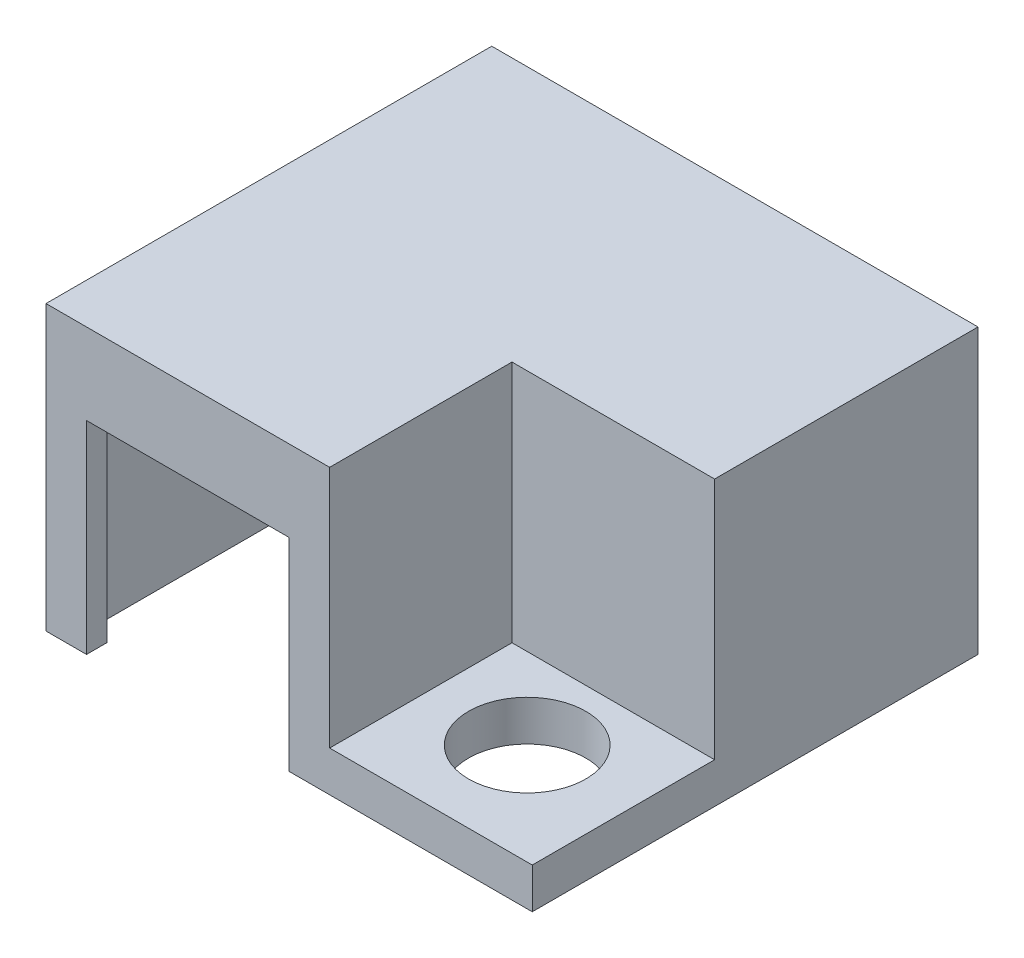
ISO-10303-21;
HEADER;
FILE_DESCRIPTION(('STEP AP214'),'2;1');
FILE_NAME('part.step','',(''),(''),'','','');
FILE_SCHEMA(('AUTOMOTIVE_DESIGN { 1 0 10303 214 1 1 1 1 }'));
ENDSEC;
DATA;
#1=APPLICATION_CONTEXT('core data for automotive mechanical design processes');
#2=APPLICATION_PROTOCOL_DEFINITION('international standard','automotive_design',2000,#1);
#3=PRODUCT_CONTEXT('',#1,'mechanical');
#4=PRODUCT('Part','Part','',(#3));
#5=PRODUCT_RELATED_PRODUCT_CATEGORY('part','',(#4));
#6=PRODUCT_DEFINITION_FORMATION('','',#4);
#7=PRODUCT_DEFINITION_CONTEXT('part definition',#1,'design');
#8=PRODUCT_DEFINITION('design','',#6,#7);
#9=PRODUCT_DEFINITION_SHAPE('','',#8);
#10=(LENGTH_UNIT() NAMED_UNIT(*) SI_UNIT(.MILLI.,.METRE.));
#11=(NAMED_UNIT(*) PLANE_ANGLE_UNIT() SI_UNIT($,.RADIAN.));
#12=(NAMED_UNIT(*) SI_UNIT($,.STERADIAN.) SOLID_ANGLE_UNIT());
#13=UNCERTAINTY_MEASURE_WITH_UNIT(LENGTH_MEASURE(1.E-05),#10,'distance_accuracy_value','');
#14=(GEOMETRIC_REPRESENTATION_CONTEXT(3) GLOBAL_UNCERTAINTY_ASSIGNED_CONTEXT((#13)) GLOBAL_UNIT_ASSIGNED_CONTEXT((#10,
#11,#12)) REPRESENTATION_CONTEXT('',''));
#15=CARTESIAN_POINT('',(0.,0.,0.));
#16=DIRECTION('',(0.,0.,1.));
#17=DIRECTION('',(1.,0.,0.));
#18=AXIS2_PLACEMENT_3D('',#15,#16,#17);
#19=CARTESIAN_POINT('',(0.,2.,0.));
#20=DIRECTION('',(1.,0.,0.));
#21=DIRECTION('',(0.,0.,-1.));
#22=AXIS2_PLACEMENT_3D('',#19,#20,#21);
#23=PLANE('',#22);
#24=DIRECTION('',(0.,0.,1.));
#25=VECTOR('',#24,1.);
#26=CARTESIAN_POINT('',(0.,0.,0.));
#27=LINE('',#26,#25);
#28=CARTESIAN_POINT('',(0.,0.,-22.));
#29=VERTEX_POINT('',#28);
#30=CARTESIAN_POINT('',(0.,0.,0.));
#31=VERTEX_POINT('',#30);
#32=EDGE_CURVE('E269',#29,#31,#27,.T.);
#33=ORIENTED_EDGE('',*,*,#32,.T.);
#34=DIRECTION('',(0.,-1.,0.));
#35=VECTOR('',#34,1.);
#36=CARTESIAN_POINT('',(0.,2.,0.));
#37=LINE('',#36,#35);
#38=CARTESIAN_POINT('',(0.,14.,0.));
#39=VERTEX_POINT('',#38);
#40=EDGE_CURVE('E242',#39,#31,#37,.T.);
#41=ORIENTED_EDGE('',*,*,#40,.F.);
#42=DIRECTION('',(0.,0.,1.));
#43=VECTOR('',#42,1.);
#44=CARTESIAN_POINT('',(0.,14.,0.));
#45=LINE('',#44,#43);
#46=CARTESIAN_POINT('',(0.,14.,-22.));
#47=VERTEX_POINT('',#46);
#48=EDGE_CURVE('E176',#47,#39,#45,.T.);
#49=ORIENTED_EDGE('',*,*,#48,.F.);
#50=DIRECTION('',(0.,-1.,0.));
#51=VECTOR('',#50,1.);
#52=CARTESIAN_POINT('',(0.,2.,-22.));
#53=LINE('',#52,#51);
#54=EDGE_CURVE('E273',#47,#29,#53,.T.);
#55=ORIENTED_EDGE('',*,*,#54,.T.);
#56=EDGE_LOOP('',(#33,#41,#49,#55));
#57=FACE_BOUND('',#56,.T.);
#58=ADVANCED_FACE('F35',(#57),#23,.F.);
#59=CARTESIAN_POINT('',(0.,2.,0.));
#60=DIRECTION('',(0.,0.,-1.));
#61=DIRECTION('',(-1.,0.,0.));
#62=AXIS2_PLACEMENT_3D('',#59,#60,#61);
#63=PLANE('',#62);
#64=DIRECTION('',(1.,0.,0.));
#65=VECTOR('',#64,1.);
#66=CARTESIAN_POINT('',(0.,0.,0.));
#67=LINE('',#66,#65);
#68=CARTESIAN_POINT('',(2.,0.,0.));
#69=VERTEX_POINT('',#68);
#70=EDGE_CURVE('E260',#31,#69,#67,.T.);
#71=ORIENTED_EDGE('',*,*,#70,.T.);
#72=DIRECTION('',(0.,-1.,0.));
#73=VECTOR('',#72,1.);
#74=CARTESIAN_POINT('',(2.,0.,0.));
#75=LINE('',#74,#73);
#76=CARTESIAN_POINT('',(2.,10.,0.));
#77=VERTEX_POINT('',#76);
#78=EDGE_CURVE('E186',#77,#69,#75,.T.);
#79=ORIENTED_EDGE('',*,*,#78,.F.);
#80=DIRECTION('',(-1.,0.,0.));
#81=VECTOR('',#80,1.);
#82=CARTESIAN_POINT('',(2.,10.,0.));
#83=LINE('',#82,#81);
#84=CARTESIAN_POINT('',(12.,10.,0.));
#85=VERTEX_POINT('',#84);
#86=EDGE_CURVE('E190',#85,#77,#83,.T.);
#87=ORIENTED_EDGE('',*,*,#86,.F.);
#88=DIRECTION('',(0.,1.,0.));
#89=VECTOR('',#88,1.);
#90=CARTESIAN_POINT('',(12.,0.,0.));
#91=LINE('',#90,#89);
#92=CARTESIAN_POINT('',(12.,0.,0.));
#93=VERTEX_POINT('',#92);
#94=EDGE_CURVE('E188',#93,#85,#91,.T.);
#95=ORIENTED_EDGE('',*,*,#94,.F.);
#96=CARTESIAN_POINT('',(24.,0.,0.));
#97=VERTEX_POINT('',#96);
#98=EDGE_CURVE('E265',#93,#97,#67,.T.);
#99=ORIENTED_EDGE('',*,*,#98,.T.);
#100=DIRECTION('',(0.,-1.,0.));
#101=VECTOR('',#100,1.);
#102=CARTESIAN_POINT('',(24.,2.,0.));
#103=LINE('',#102,#101);
#104=CARTESIAN_POINT('',(24.,2.,0.));
#105=VERTEX_POINT('',#104);
#106=EDGE_CURVE('E279',#105,#97,#103,.T.);
#107=ORIENTED_EDGE('',*,*,#106,.F.);
#108=DIRECTION('',(1.,0.,0.));
#109=VECTOR('',#108,1.);
#110=CARTESIAN_POINT('',(0.,2.,0.));
#111=LINE('',#110,#109);
#112=CARTESIAN_POINT('',(14.,2.,0.));
#113=VERTEX_POINT('',#112);
#114=EDGE_CURVE('E160',#113,#105,#111,.T.);
#115=ORIENTED_EDGE('',*,*,#114,.F.);
#116=DIRECTION('',(0.,-1.,0.));
#117=VECTOR('',#116,1.);
#118=CARTESIAN_POINT('',(14.,12.,0.));
#119=LINE('',#118,#117);
#120=CARTESIAN_POINT('',(14.,14.,0.));
#121=VERTEX_POINT('',#120);
#122=EDGE_CURVE('E57',#121,#113,#119,.T.);
#123=ORIENTED_EDGE('',*,*,#122,.F.);
#124=DIRECTION('',(1.,0.,0.));
#125=VECTOR('',#124,1.);
#126=CARTESIAN_POINT('',(14.,14.,0.));
#127=LINE('',#126,#125);
#128=EDGE_CURVE('E158',#39,#121,#127,.T.);
#129=ORIENTED_EDGE('',*,*,#128,.F.);
#130=ORIENTED_EDGE('',*,*,#40,.T.);
#131=EDGE_LOOP('',(#71,#79,#87,#95,#99,#107,#115,#123,#129,#130));
#132=FACE_BOUND('',#131,.T.);
#133=ADVANCED_FACE('F155',(#132),#63,.F.);
#134=CARTESIAN_POINT('',(24.,2.,0.));
#135=DIRECTION('',(-1.,0.,0.));
#136=DIRECTION('',(0.,0.,1.));
#137=AXIS2_PLACEMENT_3D('',#134,#135,#136);
#138=PLANE('',#137);
#139=DIRECTION('',(0.,0.,-1.));
#140=VECTOR('',#139,1.);
#141=CARTESIAN_POINT('',(24.,0.,0.));
#142=LINE('',#141,#140);
#143=CARTESIAN_POINT('',(24.,0.,-22.));
#144=VERTEX_POINT('',#143);
#145=EDGE_CURVE('E264',#97,#144,#142,.T.);
#146=ORIENTED_EDGE('',*,*,#145,.T.);
#147=DIRECTION('',(0.,-1.,0.));
#148=VECTOR('',#147,1.);
#149=CARTESIAN_POINT('',(24.,2.,-22.));
#150=LINE('',#149,#148);
#151=CARTESIAN_POINT('',(24.,14.,-22.));
#152=VERTEX_POINT('',#151);
#153=EDGE_CURVE('E276',#152,#144,#150,.T.);
#154=ORIENTED_EDGE('',*,*,#153,.F.);
#155=DIRECTION('',(0.,0.,-1.));
#156=VECTOR('',#155,1.);
#157=CARTESIAN_POINT('',(24.,14.,-22.));
#158=LINE('',#157,#156);
#159=CARTESIAN_POINT('',(24.,14.,-9.));
#160=VERTEX_POINT('',#159);
#161=EDGE_CURVE('E180',#160,#152,#158,.T.);
#162=ORIENTED_EDGE('',*,*,#161,.F.);
#163=DIRECTION('',(0.,-1.,0.));
#164=VECTOR('',#163,1.);
#165=CARTESIAN_POINT('',(24.,12.,-9.));
#166=LINE('',#165,#164);
#167=CARTESIAN_POINT('',(24.,2.,-9.));
#168=VERTEX_POINT('',#167);
#169=EDGE_CURVE('E161',#160,#168,#166,.T.);
#170=ORIENTED_EDGE('',*,*,#169,.T.);
#171=DIRECTION('',(0.,0.,-1.));
#172=VECTOR('',#171,1.);
#173=CARTESIAN_POINT('',(24.,2.,0.));
#174=LINE('',#173,#172);
#175=EDGE_CURVE('E226',#105,#168,#174,.T.);
#176=ORIENTED_EDGE('',*,*,#175,.F.);
#177=ORIENTED_EDGE('',*,*,#106,.T.);
#178=EDGE_LOOP('',(#146,#154,#162,#170,#176,#177));
#179=FACE_BOUND('',#178,.T.);
#180=ADVANCED_FACE('F336',(#179),#138,.F.);
#181=CARTESIAN_POINT('',(0.,2.,-22.));
#182=DIRECTION('',(0.,0.,1.));
#183=DIRECTION('',(1.,0.,0.));
#184=AXIS2_PLACEMENT_3D('',#181,#182,#183);
#185=PLANE('',#184);
#186=DIRECTION('',(-1.,0.,0.));
#187=VECTOR('',#186,1.);
#188=CARTESIAN_POINT('',(0.,0.,-22.));
#189=LINE('',#188,#187);
#190=EDGE_CURVE('E267',#144,#29,#189,.T.);
#191=ORIENTED_EDGE('',*,*,#190,.T.);
#192=ORIENTED_EDGE('',*,*,#54,.F.);
#193=DIRECTION('',(-1.,0.,0.));
#194=VECTOR('',#193,1.);
#195=CARTESIAN_POINT('',(0.,14.,-22.));
#196=LINE('',#195,#194);
#197=EDGE_CURVE('E183',#152,#47,#196,.T.);
#198=ORIENTED_EDGE('',*,*,#197,.F.);
#199=ORIENTED_EDGE('',*,*,#153,.T.);
#200=EDGE_LOOP('',(#191,#192,#198,#199));
#201=FACE_BOUND('',#200,.T.);
#202=ADVANCED_FACE('F330',(#201),#185,.F.);
#203=CARTESIAN_POINT('',(0.,2.,0.));
#204=DIRECTION('',(0.,-1.,0.));
#205=DIRECTION('',(0.,0.,-1.));
#206=AXIS2_PLACEMENT_3D('',#203,#204,#205);
#207=PLANE('',#206);
#208=CARTESIAN_POINT('',(18.75,2.,-5.));
#209=DIRECTION('',(0.,1.,0.));
#210=DIRECTION('',(0.,0.,1.));
#211=AXIS2_PLACEMENT_3D('',#208,#209,#210);
#212=CIRCLE('',#211,2.89465520900429);
#213=CARTESIAN_POINT('',(18.75,2.,-2.10534479099571));
#214=VERTEX_POINT('',#213);
#215=EDGE_CURVE('E233',#214,#214,#212,.T.);
#216=ORIENTED_EDGE('',*,*,#215,.F.);
#217=EDGE_LOOP('',(#216));
#218=FACE_BOUND('',#217,.T.);
#219=ORIENTED_EDGE('',*,*,#175,.T.);
#220=DIRECTION('',(-1.,0.,0.));
#221=VECTOR('',#220,1.);
#222=CARTESIAN_POINT('',(0.,2.,-9.));
#223=LINE('',#222,#221);
#224=CARTESIAN_POINT('',(14.,2.,-9.));
#225=VERTEX_POINT('',#224);
#226=EDGE_CURVE('E196',#168,#225,#223,.T.);
#227=ORIENTED_EDGE('',*,*,#226,.T.);
#228=DIRECTION('',(0.,0.,1.));
#229=VECTOR('',#228,1.);
#230=CARTESIAN_POINT('',(14.,2.,0.));
#231=LINE('',#230,#229);
#232=EDGE_CURVE('E206',#225,#113,#231,.T.);
#233=ORIENTED_EDGE('',*,*,#232,.T.);
#234=ORIENTED_EDGE('',*,*,#114,.T.);
#235=EDGE_LOOP('',(#219,#227,#233,#234));
#236=FACE_BOUND('',#235,.T.);
#237=ADVANCED_FACE('F327',(#218,#236),#207,.F.);
#238=CARTESIAN_POINT('',(0.,0.,0.));
#239=DIRECTION('',(0.,-1.,0.));
#240=DIRECTION('',(0.,0.,-1.));
#241=AXIS2_PLACEMENT_3D('',#238,#239,#240);
#242=PLANE('',#241);
#243=DIRECTION('',(0.,0.,1.));
#244=VECTOR('',#243,1.);
#245=CARTESIAN_POINT('',(2.,0.,-10.));
#246=LINE('',#245,#244);
#247=CARTESIAN_POINT('',(2.,0.,-0.999999999999996));
#248=VERTEX_POINT('',#247);
#249=EDGE_CURVE('E193',#248,#69,#246,.T.);
#250=ORIENTED_EDGE('',*,*,#249,.T.);
#251=ORIENTED_EDGE('',*,*,#70,.F.);
#252=ORIENTED_EDGE('',*,*,#32,.F.);
#253=ORIENTED_EDGE('',*,*,#190,.F.);
#254=ORIENTED_EDGE('',*,*,#145,.F.);
#255=ORIENTED_EDGE('',*,*,#98,.F.);
#256=DIRECTION('',(0.,0.,1.));
#257=VECTOR('',#256,1.);
#258=CARTESIAN_POINT('',(12.,0.,-10.));
#259=LINE('',#258,#257);
#260=CARTESIAN_POINT('',(12.,0.,-0.999999999999996));
#261=VERTEX_POINT('',#260);
#262=EDGE_CURVE('E198',#261,#93,#259,.T.);
#263=ORIENTED_EDGE('',*,*,#262,.F.);
#264=DIRECTION('',(1.,0.,0.));
#265=VECTOR('',#264,1.);
#266=CARTESIAN_POINT('',(13.,0.,-0.999999999999996));
#267=LINE('',#266,#265);
#268=CARTESIAN_POINT('',(13.,0.,-0.999999999999996));
#269=VERTEX_POINT('',#268);
#270=EDGE_CURVE('E312',#261,#269,#267,.T.);
#271=ORIENTED_EDGE('',*,*,#270,.T.);
#272=DIRECTION('',(0.,0.,-1.));
#273=VECTOR('',#272,1.);
#274=CARTESIAN_POINT('',(13.,0.,-9.99999999999999));
#275=LINE('',#274,#273);
#276=CARTESIAN_POINT('',(13.,0.,-9.99999999999999));
#277=VERTEX_POINT('',#276);
#278=EDGE_CURVE('E308',#269,#277,#275,.T.);
#279=ORIENTED_EDGE('',*,*,#278,.T.);
#280=DIRECTION('',(1.,0.,0.));
#281=VECTOR('',#280,1.);
#282=CARTESIAN_POINT('',(23.,0.,-10.));
#283=LINE('',#282,#281);
#284=CARTESIAN_POINT('',(23.,0.,-10.));
#285=VERTEX_POINT('',#284);
#286=EDGE_CURVE('E305',#277,#285,#283,.T.);
#287=ORIENTED_EDGE('',*,*,#286,.T.);
#288=DIRECTION('',(0.,0.,-1.));
#289=VECTOR('',#288,1.);
#290=CARTESIAN_POINT('',(23.,0.,-21.));
#291=LINE('',#290,#289);
#292=CARTESIAN_POINT('',(23.,0.,-21.));
#293=VERTEX_POINT('',#292);
#294=EDGE_CURVE('E302',#285,#293,#291,.T.);
#295=ORIENTED_EDGE('',*,*,#294,.T.);
#296=DIRECTION('',(-1.,0.,0.));
#297=VECTOR('',#296,1.);
#298=CARTESIAN_POINT('',(1.,0.,-21.));
#299=LINE('',#298,#297);
#300=CARTESIAN_POINT('',(1.,0.,-21.));
#301=VERTEX_POINT('',#300);
#302=EDGE_CURVE('E290',#293,#301,#299,.T.);
#303=ORIENTED_EDGE('',*,*,#302,.T.);
#304=DIRECTION('',(0.,0.,1.));
#305=VECTOR('',#304,1.);
#306=CARTESIAN_POINT('',(1.,0.,-0.999999999999996));
#307=LINE('',#306,#305);
#308=CARTESIAN_POINT('',(1.,0.,-0.999999999999996));
#309=VERTEX_POINT('',#308);
#310=EDGE_CURVE('E313',#301,#309,#307,.T.);
#311=ORIENTED_EDGE('',*,*,#310,.T.);
#312=EDGE_CURVE('E262',#309,#248,#267,.T.);
#313=ORIENTED_EDGE('',*,*,#312,.T.);
#314=EDGE_LOOP('',(#250,#251,#252,#253,#254,#255,#263,#271,#279,#287,#295,#303,#311,#313));
#315=FACE_BOUND('',#314,.T.);
#316=CARTESIAN_POINT('',(18.75,0.,-5.));
#317=DIRECTION('',(0.,1.,0.));
#318=DIRECTION('',(0.,0.,1.));
#319=AXIS2_PLACEMENT_3D('',#316,#317,#318);
#320=CIRCLE('',#319,2.89465520900429);
#321=CARTESIAN_POINT('',(18.75,0.,-2.10534479099571));
#322=VERTEX_POINT('',#321);
#323=EDGE_CURVE('E315',#322,#322,#320,.T.);
#324=ORIENTED_EDGE('',*,*,#323,.T.);
#325=EDGE_LOOP('',(#324));
#326=FACE_BOUND('',#325,.T.);
#327=ADVANCED_FACE('F257',(#315,#326),#242,.T.);
#328=CARTESIAN_POINT('',(1.,0.,-0.999999999999996));
#329=DIRECTION('',(-1.,0.,0.));
#330=DIRECTION('',(0.,0.,1.));
#331=AXIS2_PLACEMENT_3D('',#328,#329,#330);
#332=PLANE('',#331);
#333=DIRECTION('',(0.,1.,0.));
#334=VECTOR('',#333,1.);
#335=CARTESIAN_POINT('',(1.,0.,-21.));
#336=LINE('',#335,#334);
#337=CARTESIAN_POINT('',(1.,12.,-21.));
#338=VERTEX_POINT('',#337);
#339=EDGE_CURVE('E298',#301,#338,#336,.T.);
#340=ORIENTED_EDGE('',*,*,#339,.T.);
#341=DIRECTION('',(0.,0.,-1.));
#342=VECTOR('',#341,1.);
#343=CARTESIAN_POINT('',(1.,12.,0.));
#344=LINE('',#343,#342);
#345=CARTESIAN_POINT('',(1.,12.,-0.999999999999996));
#346=VERTEX_POINT('',#345);
#347=EDGE_CURVE('E209',#346,#338,#344,.T.);
#348=ORIENTED_EDGE('',*,*,#347,.F.);
#349=DIRECTION('',(0.,1.,0.));
#350=VECTOR('',#349,1.);
#351=CARTESIAN_POINT('',(1.,0.,-0.999999999999996));
#352=LINE('',#351,#350);
#353=EDGE_CURVE('E285',#309,#346,#352,.T.);
#354=ORIENTED_EDGE('',*,*,#353,.F.);
#355=ORIENTED_EDGE('',*,*,#310,.F.);
#356=EDGE_LOOP('',(#340,#348,#354,#355));
#357=FACE_BOUND('',#356,.T.);
#358=ADVANCED_FACE('F370',(#357),#332,.F.);
#359=CARTESIAN_POINT('',(1.,0.,-21.));
#360=DIRECTION('',(0.,0.,-1.));
#361=DIRECTION('',(-1.,0.,0.));
#362=AXIS2_PLACEMENT_3D('',#359,#360,#361);
#363=PLANE('',#362);
#364=DIRECTION('',(0.,1.,0.));
#365=VECTOR('',#364,1.);
#366=CARTESIAN_POINT('',(23.,0.,-21.));
#367=LINE('',#366,#365);
#368=CARTESIAN_POINT('',(23.,12.,-21.));
#369=VERTEX_POINT('',#368);
#370=EDGE_CURVE('E296',#293,#369,#367,.T.);
#371=ORIENTED_EDGE('',*,*,#370,.T.);
#372=DIRECTION('',(1.,0.,0.));
#373=VECTOR('',#372,1.);
#374=CARTESIAN_POINT('',(0.,12.,-21.));
#375=LINE('',#374,#373);
#376=EDGE_CURVE('E212',#338,#369,#375,.T.);
#377=ORIENTED_EDGE('',*,*,#376,.F.);
#378=ORIENTED_EDGE('',*,*,#339,.F.);
#379=ORIENTED_EDGE('',*,*,#302,.F.);
#380=EDGE_LOOP('',(#371,#377,#378,#379));
#381=FACE_BOUND('',#380,.T.);
#382=ADVANCED_FACE('F374',(#381),#363,.F.);
#383=CARTESIAN_POINT('',(23.,0.,-21.));
#384=DIRECTION('',(1.,0.,0.));
#385=DIRECTION('',(0.,0.,-1.));
#386=AXIS2_PLACEMENT_3D('',#383,#384,#385);
#387=PLANE('',#386);
#388=DIRECTION('',(0.,1.,0.));
#389=VECTOR('',#388,1.);
#390=CARTESIAN_POINT('',(23.,0.,-10.));
#391=LINE('',#390,#389);
#392=CARTESIAN_POINT('',(23.,12.,-10.));
#393=VERTEX_POINT('',#392);
#394=EDGE_CURVE('E294',#285,#393,#391,.T.);
#395=ORIENTED_EDGE('',*,*,#394,.T.);
#396=DIRECTION('',(0.,0.,1.));
#397=VECTOR('',#396,1.);
#398=CARTESIAN_POINT('',(23.,12.,0.));
#399=LINE('',#398,#397);
#400=EDGE_CURVE('E215',#369,#393,#399,.T.);
#401=ORIENTED_EDGE('',*,*,#400,.F.);
#402=ORIENTED_EDGE('',*,*,#370,.F.);
#403=ORIENTED_EDGE('',*,*,#294,.F.);
#404=EDGE_LOOP('',(#395,#401,#402,#403));
#405=FACE_BOUND('',#404,.T.);
#406=ADVANCED_FACE('F385',(#405),#387,.F.);
#407=CARTESIAN_POINT('',(23.,0.,-10.));
#408=DIRECTION('',(0.,0.,1.));
#409=DIRECTION('',(1.,0.,0.));
#410=AXIS2_PLACEMENT_3D('',#407,#408,#409);
#411=PLANE('',#410);
#412=DIRECTION('',(0.,1.,0.));
#413=VECTOR('',#412,1.);
#414=CARTESIAN_POINT('',(13.,0.,-9.99999999999999));
#415=LINE('',#414,#413);
#416=CARTESIAN_POINT('',(13.,12.,-9.99999999999999));
#417=VERTEX_POINT('',#416);
#418=EDGE_CURVE('E292',#277,#417,#415,.T.);
#419=ORIENTED_EDGE('',*,*,#418,.T.);
#420=DIRECTION('',(-1.,0.,0.));
#421=VECTOR('',#420,1.);
#422=CARTESIAN_POINT('',(0.,12.,-9.99999999999999));
#423=LINE('',#422,#421);
#424=EDGE_CURVE('E218',#393,#417,#423,.T.);
#425=ORIENTED_EDGE('',*,*,#424,.F.);
#426=ORIENTED_EDGE('',*,*,#394,.F.);
#427=ORIENTED_EDGE('',*,*,#286,.F.);
#428=EDGE_LOOP('',(#419,#425,#426,#427));
#429=FACE_BOUND('',#428,.T.);
#430=ADVANCED_FACE('F381',(#429),#411,.F.);
#431=CARTESIAN_POINT('',(13.,0.,-9.99999999999999));
#432=DIRECTION('',(1.,0.,0.));
#433=DIRECTION('',(0.,0.,-1.));
#434=AXIS2_PLACEMENT_3D('',#431,#432,#433);
#435=PLANE('',#434);
#436=DIRECTION('',(0.,1.,0.));
#437=VECTOR('',#436,1.);
#438=CARTESIAN_POINT('',(13.,0.,-0.999999999999996));
#439=LINE('',#438,#437);
#440=CARTESIAN_POINT('',(13.,12.,-0.999999999999996));
#441=VERTEX_POINT('',#440);
#442=EDGE_CURVE('E289',#269,#441,#439,.T.);
#443=ORIENTED_EDGE('',*,*,#442,.T.);
#444=DIRECTION('',(0.,0.,1.));
#445=VECTOR('',#444,1.);
#446=CARTESIAN_POINT('',(13.,12.,0.));
#447=LINE('',#446,#445);
#448=EDGE_CURVE('E202',#417,#441,#447,.T.);
#449=ORIENTED_EDGE('',*,*,#448,.F.);
#450=ORIENTED_EDGE('',*,*,#418,.F.);
#451=ORIENTED_EDGE('',*,*,#278,.F.);
#452=EDGE_LOOP('',(#443,#449,#450,#451));
#453=FACE_BOUND('',#452,.T.);
#454=ADVANCED_FACE('F378',(#453),#435,.F.);
#455=CARTESIAN_POINT('',(13.,0.,-0.999999999999996));
#456=DIRECTION('',(0.,0.,1.));
#457=DIRECTION('',(1.,0.,0.));
#458=AXIS2_PLACEMENT_3D('',#455,#456,#457);
#459=PLANE('',#458);
#460=DIRECTION('',(-1.,0.,0.));
#461=VECTOR('',#460,1.);
#462=CARTESIAN_POINT('',(13.,10.,-0.999999999999996));
#463=LINE('',#462,#461);
#464=CARTESIAN_POINT('',(12.,10.,-0.999999999999996));
#465=VERTEX_POINT('',#464);
#466=CARTESIAN_POINT('',(2.,10.,-0.999999999999996));
#467=VERTEX_POINT('',#466);
#468=EDGE_CURVE('E42',#465,#467,#463,.T.);
#469=ORIENTED_EDGE('',*,*,#468,.T.);
#470=DIRECTION('',(0.,-1.,0.));
#471=VECTOR('',#470,1.);
#472=CARTESIAN_POINT('',(2.,0.,-0.999999999999996));
#473=LINE('',#472,#471);
#474=EDGE_CURVE('E11',#467,#248,#473,.T.);
#475=ORIENTED_EDGE('',*,*,#474,.T.);
#476=ORIENTED_EDGE('',*,*,#312,.F.);
#477=ORIENTED_EDGE('',*,*,#353,.T.);
#478=DIRECTION('',(-1.,0.,0.));
#479=VECTOR('',#478,1.);
#480=CARTESIAN_POINT('',(0.,12.,-0.999999999999996));
#481=LINE('',#480,#479);
#482=EDGE_CURVE('E205',#441,#346,#481,.T.);
#483=ORIENTED_EDGE('',*,*,#482,.F.);
#484=ORIENTED_EDGE('',*,*,#442,.F.);
#485=ORIENTED_EDGE('',*,*,#270,.F.);
#486=DIRECTION('',(0.,1.,0.));
#487=VECTOR('',#486,1.);
#488=CARTESIAN_POINT('',(12.,0.,-0.999999999999996));
#489=LINE('',#488,#487);
#490=EDGE_CURVE('E240',#261,#465,#489,.T.);
#491=ORIENTED_EDGE('',*,*,#490,.T.);
#492=EDGE_LOOP('',(#469,#475,#476,#477,#483,#484,#485,#491));
#493=FACE_BOUND('',#492,.T.);
#494=ADVANCED_FACE('F245',(#493),#459,.F.);
#495=CARTESIAN_POINT('',(18.75,0.,-5.));
#496=DIRECTION('',(0.,1.,0.));
#497=DIRECTION('',(0.,0.,1.));
#498=AXIS2_PLACEMENT_3D('',#495,#496,#497);
#499=CYLINDRICAL_SURFACE('',#498,2.89465520900429);
#500=ORIENTED_EDGE('',*,*,#323,.F.);
#501=EDGE_LOOP('',(#500));
#502=FACE_BOUND('',#501,.T.);
#503=ORIENTED_EDGE('',*,*,#215,.T.);
#504=EDGE_LOOP('',(#503));
#505=FACE_BOUND('',#504,.T.);
#506=ADVANCED_FACE('F320',(#502,#505),#499,.F.);
#507=CARTESIAN_POINT('',(0.,12.,-9.));
#508=DIRECTION('',(0.,0.,1.));
#509=DIRECTION('',(1.,0.,0.));
#510=AXIS2_PLACEMENT_3D('',#507,#508,#509);
#511=PLANE('',#510);
#512=ORIENTED_EDGE('',*,*,#226,.F.);
#513=ORIENTED_EDGE('',*,*,#169,.F.);
#514=DIRECTION('',(1.,0.,0.));
#515=VECTOR('',#514,1.);
#516=CARTESIAN_POINT('',(24.,14.,-9.));
#517=LINE('',#516,#515);
#518=CARTESIAN_POINT('',(14.,14.,-9.));
#519=VERTEX_POINT('',#518);
#520=EDGE_CURVE('E170',#519,#160,#517,.T.);
#521=ORIENTED_EDGE('',*,*,#520,.F.);
#522=DIRECTION('',(0.,-1.,0.));
#523=VECTOR('',#522,1.);
#524=CARTESIAN_POINT('',(14.,12.,-9.));
#525=LINE('',#524,#523);
#526=EDGE_CURVE('E162',#519,#225,#525,.T.);
#527=ORIENTED_EDGE('',*,*,#526,.T.);
#528=EDGE_LOOP('',(#512,#513,#521,#527));
#529=FACE_BOUND('',#528,.T.);
#530=ADVANCED_FACE('F323',(#529),#511,.T.);
#531=CARTESIAN_POINT('',(14.,12.,0.));
#532=DIRECTION('',(1.,0.,0.));
#533=DIRECTION('',(0.,0.,-1.));
#534=AXIS2_PLACEMENT_3D('',#531,#532,#533);
#535=PLANE('',#534);
#536=ORIENTED_EDGE('',*,*,#232,.F.);
#537=ORIENTED_EDGE('',*,*,#526,.F.);
#538=DIRECTION('',(0.,0.,-1.));
#539=VECTOR('',#538,1.);
#540=CARTESIAN_POINT('',(14.,14.,-9.));
#541=LINE('',#540,#539);
#542=EDGE_CURVE('E165',#121,#519,#541,.T.);
#543=ORIENTED_EDGE('',*,*,#542,.F.);
#544=ORIENTED_EDGE('',*,*,#122,.T.);
#545=EDGE_LOOP('',(#536,#537,#543,#544));
#546=FACE_BOUND('',#545,.T.);
#547=ADVANCED_FACE('F166',(#546),#535,.T.);
#548=CARTESIAN_POINT('',(2.,0.,-10.));
#549=DIRECTION('',(-1.,0.,0.));
#550=DIRECTION('',(0.,0.,1.));
#551=AXIS2_PLACEMENT_3D('',#548,#549,#550);
#552=PLANE('',#551);
#553=DIRECTION('',(0.,0.,1.));
#554=VECTOR('',#553,1.);
#555=CARTESIAN_POINT('',(2.,10.,-10.));
#556=LINE('',#555,#554);
#557=EDGE_CURVE('E194',#467,#77,#556,.T.);
#558=ORIENTED_EDGE('',*,*,#557,.T.);
#559=ORIENTED_EDGE('',*,*,#78,.T.);
#560=ORIENTED_EDGE('',*,*,#249,.F.);
#561=ORIENTED_EDGE('',*,*,#474,.F.);
#562=EDGE_LOOP('',(#558,#559,#560,#561));
#563=FACE_BOUND('',#562,.T.);
#564=ADVANCED_FACE('F255',(#563),#552,.F.);
#565=CARTESIAN_POINT('',(2.,10.,-10.));
#566=DIRECTION('',(0.,1.,0.));
#567=DIRECTION('',(0.,0.,1.));
#568=AXIS2_PLACEMENT_3D('',#565,#566,#567);
#569=PLANE('',#568);
#570=DIRECTION('',(0.,0.,1.));
#571=VECTOR('',#570,1.);
#572=CARTESIAN_POINT('',(12.,10.,-10.));
#573=LINE('',#572,#571);
#574=EDGE_CURVE('E49',#465,#85,#573,.T.);
#575=ORIENTED_EDGE('',*,*,#574,.T.);
#576=ORIENTED_EDGE('',*,*,#86,.T.);
#577=ORIENTED_EDGE('',*,*,#557,.F.);
#578=ORIENTED_EDGE('',*,*,#468,.F.);
#579=EDGE_LOOP('',(#575,#576,#577,#578));
#580=FACE_BOUND('',#579,.T.);
#581=ADVANCED_FACE('F251',(#580),#569,.F.);
#582=CARTESIAN_POINT('',(12.,0.,-10.));
#583=DIRECTION('',(1.,0.,0.));
#584=DIRECTION('',(0.,0.,-1.));
#585=AXIS2_PLACEMENT_3D('',#582,#583,#584);
#586=PLANE('',#585);
#587=ORIENTED_EDGE('',*,*,#262,.T.);
#588=ORIENTED_EDGE('',*,*,#94,.T.);
#589=ORIENTED_EDGE('',*,*,#574,.F.);
#590=ORIENTED_EDGE('',*,*,#490,.F.);
#591=EDGE_LOOP('',(#587,#588,#589,#590));
#592=FACE_BOUND('',#591,.T.);
#593=ADVANCED_FACE('F347',(#592),#586,.F.);
#594=CARTESIAN_POINT('',(0.,14.,0.));
#595=DIRECTION('',(0.,-1.,0.));
#596=DIRECTION('',(0.,0.,-1.));
#597=AXIS2_PLACEMENT_3D('',#594,#595,#596);
#598=PLANE('',#597);
#599=ORIENTED_EDGE('',*,*,#128,.T.);
#600=ORIENTED_EDGE('',*,*,#542,.T.);
#601=ORIENTED_EDGE('',*,*,#520,.T.);
#602=ORIENTED_EDGE('',*,*,#161,.T.);
#603=ORIENTED_EDGE('',*,*,#197,.T.);
#604=ORIENTED_EDGE('',*,*,#48,.T.);
#605=EDGE_LOOP('',(#599,#600,#601,#602,#603,#604));
#606=FACE_BOUND('',#605,.T.);
#607=ADVANCED_FACE('F173',(#606),#598,.F.);
#608=CARTESIAN_POINT('',(0.,12.,0.));
#609=DIRECTION('',(0.,-1.,0.));
#610=DIRECTION('',(0.,0.,-1.));
#611=AXIS2_PLACEMENT_3D('',#608,#609,#610);
#612=PLANE('',#611);
#613=ORIENTED_EDGE('',*,*,#347,.T.);
#614=ORIENTED_EDGE('',*,*,#376,.T.);
#615=ORIENTED_EDGE('',*,*,#400,.T.);
#616=ORIENTED_EDGE('',*,*,#424,.T.);
#617=ORIENTED_EDGE('',*,*,#448,.T.);
#618=ORIENTED_EDGE('',*,*,#482,.T.);
#619=EDGE_LOOP('',(#613,#614,#615,#616,#617,#618));
#620=FACE_BOUND('',#619,.T.);
#621=ADVANCED_FACE('F354',(#620),#612,.T.);
#622=CLOSED_SHELL('',(#58,#133,#180,#202,#237,#327,#358,#382,#406,#430,#454,#494,#506,#530,#547,
#564,#581,#593,#607,#621));
#623=MANIFOLD_SOLID_BREP('B2',#622);
#624=ADVANCED_BREP_SHAPE_REPRESENTATION('',(#18,#623),#14);
#625=SHAPE_DEFINITION_REPRESENTATION(#9,#624);
ENDSEC;
END-ISO-10303-21;
